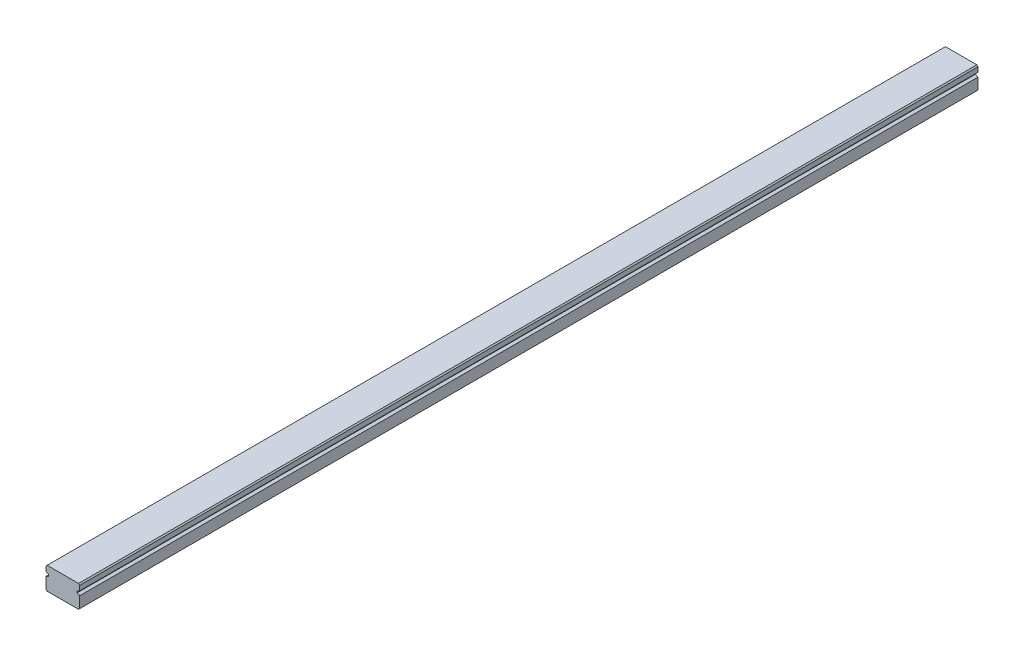
ISO-10303-21;
HEADER;
FILE_DESCRIPTION(('STEP AP214'),'2;1');
FILE_NAME('part.step','',(''),(''),'','','');
FILE_SCHEMA(('AUTOMOTIVE_DESIGN { 1 0 10303 214 1 1 1 1 }'));
ENDSEC;
DATA;
#1=APPLICATION_CONTEXT('core data for automotive mechanical design processes');
#2=APPLICATION_PROTOCOL_DEFINITION('international standard','automotive_design',2000,#1);
#3=PRODUCT_CONTEXT('',#1,'mechanical');
#4=PRODUCT('Part','Part','',(#3));
#5=PRODUCT_RELATED_PRODUCT_CATEGORY('part','',(#4));
#6=PRODUCT_DEFINITION_FORMATION('','',#4);
#7=PRODUCT_DEFINITION_CONTEXT('part definition',#1,'design');
#8=PRODUCT_DEFINITION('design','',#6,#7);
#9=PRODUCT_DEFINITION_SHAPE('','',#8);
#10=(LENGTH_UNIT() NAMED_UNIT(*) SI_UNIT(.MILLI.,.METRE.));
#11=(NAMED_UNIT(*) PLANE_ANGLE_UNIT() SI_UNIT($,.RADIAN.));
#12=(NAMED_UNIT(*) SI_UNIT($,.STERADIAN.) SOLID_ANGLE_UNIT());
#13=UNCERTAINTY_MEASURE_WITH_UNIT(LENGTH_MEASURE(1.E-05),#10,'distance_accuracy_value','');
#14=(GEOMETRIC_REPRESENTATION_CONTEXT(3) GLOBAL_UNCERTAINTY_ASSIGNED_CONTEXT((#13)) GLOBAL_UNIT_ASSIGNED_CONTEXT((#10,
#11,#12)) REPRESENTATION_CONTEXT('',''));
#15=CARTESIAN_POINT('',(0.,0.,0.));
#16=DIRECTION('',(0.,0.,1.));
#17=DIRECTION('',(1.,0.,0.));
#18=AXIS2_PLACEMENT_3D('',#15,#16,#17);
#19=CARTESIAN_POINT('',(11.2309644670051,0.449238578680204,-400.));
#20=DIRECTION('',(1.,0.,0.));
#21=DIRECTION('',(0.,1.,0.));
#22=AXIS2_PLACEMENT_3D('',#19,#20,#21);
#23=PLANE('',#22);
#24=DIRECTION('',(0.,1.,0.));
#25=VECTOR('',#24,1.);
#26=CARTESIAN_POINT('',(11.2309644670051,0.449238578680204,0.));
#27=LINE('',#26,#25);
#28=CARTESIAN_POINT('',(11.2309644670051,-4.5507614213198,0.));
#29=VERTEX_POINT('',#28);
#30=CARTESIAN_POINT('',(11.2309644670051,0.449238578680204,0.));
#31=VERTEX_POINT('',#30);
#32=EDGE_CURVE('E190',#29,#31,#27,.T.);
#33=ORIENTED_EDGE('',*,*,#32,.F.);
#34=DIRECTION('',(0.,0.,1.));
#35=VECTOR('',#34,1.);
#36=CARTESIAN_POINT('',(11.2309644670051,-4.5507614213198,-400.));
#37=LINE('',#36,#35);
#38=CARTESIAN_POINT('',(11.2309644670051,-4.5507614213198,-400.));
#39=VERTEX_POINT('',#38);
#40=EDGE_CURVE('E11',#39,#29,#37,.T.);
#41=ORIENTED_EDGE('',*,*,#40,.F.);
#42=DIRECTION('',(0.,1.,0.));
#43=VECTOR('',#42,1.);
#44=CARTESIAN_POINT('',(11.2309644670051,0.449238578680204,-400.));
#45=LINE('',#44,#43);
#46=CARTESIAN_POINT('',(11.2309644670051,0.449238578680204,-400.));
#47=VERTEX_POINT('',#46);
#48=EDGE_CURVE('E250',#39,#47,#45,.T.);
#49=ORIENTED_EDGE('',*,*,#48,.T.);
#50=DIRECTION('',(0.,0.,1.));
#51=VECTOR('',#50,1.);
#52=CARTESIAN_POINT('',(11.2309644670051,0.449238578680204,-400.));
#53=LINE('',#52,#51);
#54=EDGE_CURVE('E42',#47,#31,#53,.T.);
#55=ORIENTED_EDGE('',*,*,#54,.T.);
#56=EDGE_LOOP('',(#33,#41,#49,#55));
#57=FACE_BOUND('',#56,.T.);
#58=ADVANCED_FACE('F39',(#57),#23,.T.);
#59=CARTESIAN_POINT('',(11.2309644670051,-4.5507614213198,-400.));
#60=DIRECTION('',(0.707106781186547,-0.707106781186548,0.));
#61=DIRECTION('',(0.707106781186548,0.707106781186547,0.));
#62=AXIS2_PLACEMENT_3D('',#59,#60,#61);
#63=PLANE('',#62);
#64=DIRECTION('',(0.707106781186548,0.707106781186547,0.));
#65=VECTOR('',#64,1.);
#66=CARTESIAN_POINT('',(11.2309644670051,-4.5507614213198,0.));
#67=LINE('',#66,#65);
#68=CARTESIAN_POINT('',(10.7309644670051,-5.0507614213198,0.));
#69=VERTEX_POINT('',#68);
#70=EDGE_CURVE('E247',#69,#29,#67,.T.);
#71=ORIENTED_EDGE('',*,*,#70,.F.);
#72=DIRECTION('',(0.,0.,1.));
#73=VECTOR('',#72,1.);
#74=CARTESIAN_POINT('',(10.7309644670051,-5.0507614213198,-400.));
#75=LINE('',#74,#73);
#76=CARTESIAN_POINT('',(10.7309644670051,-5.0507614213198,-400.));
#77=VERTEX_POINT('',#76);
#78=EDGE_CURVE('E49',#77,#69,#75,.T.);
#79=ORIENTED_EDGE('',*,*,#78,.F.);
#80=DIRECTION('',(0.707106781186548,0.707106781186547,0.));
#81=VECTOR('',#80,1.);
#82=CARTESIAN_POINT('',(11.2309644670051,-4.5507614213198,-400.));
#83=LINE('',#82,#81);
#84=EDGE_CURVE('E176',#77,#39,#83,.T.);
#85=ORIENTED_EDGE('',*,*,#84,.T.);
#86=ORIENTED_EDGE('',*,*,#40,.T.);
#87=EDGE_LOOP('',(#71,#79,#85,#86));
#88=FACE_BOUND('',#87,.T.);
#89=ADVANCED_FACE('F292',(#88),#63,.T.);
#90=CARTESIAN_POINT('',(-3.26903553299492,-5.0507614213198,-400.));
#91=DIRECTION('',(0.,-1.,0.));
#92=DIRECTION('',(0.,0.,-1.));
#93=AXIS2_PLACEMENT_3D('',#90,#91,#92);
#94=PLANE('',#93);
#95=DIRECTION('',(1.,0.,0.));
#96=VECTOR('',#95,1.);
#97=CARTESIAN_POINT('',(-3.26903553299492,-5.0507614213198,0.));
#98=LINE('',#97,#96);
#99=CARTESIAN_POINT('',(-3.26903553299492,-5.0507614213198,0.));
#100=VERTEX_POINT('',#99);
#101=EDGE_CURVE('E162',#100,#69,#98,.T.);
#102=ORIENTED_EDGE('',*,*,#101,.F.);
#103=DIRECTION('',(0.,0.,1.));
#104=VECTOR('',#103,1.);
#105=CARTESIAN_POINT('',(-3.26903553299492,-5.0507614213198,-400.));
#106=LINE('',#105,#104);
#107=CARTESIAN_POINT('',(-3.26903553299492,-5.0507614213198,-400.));
#108=VERTEX_POINT('',#107);
#109=EDGE_CURVE('E157',#108,#100,#106,.T.);
#110=ORIENTED_EDGE('',*,*,#109,.F.);
#111=DIRECTION('',(1.,0.,0.));
#112=VECTOR('',#111,1.);
#113=CARTESIAN_POINT('',(-3.26903553299492,-5.0507614213198,-400.));
#114=LINE('',#113,#112);
#115=EDGE_CURVE('E160',#108,#77,#114,.T.);
#116=ORIENTED_EDGE('',*,*,#115,.T.);
#117=ORIENTED_EDGE('',*,*,#78,.T.);
#118=EDGE_LOOP('',(#102,#110,#116,#117));
#119=FACE_BOUND('',#118,.T.);
#120=ADVANCED_FACE('F159',(#119),#94,.T.);
#121=CARTESIAN_POINT('',(-3.76903553299492,-4.5507614213198,-400.));
#122=DIRECTION('',(-0.707106781186547,-0.707106781186548,0.));
#123=DIRECTION('',(0.707106781186548,-0.707106781186547,0.));
#124=AXIS2_PLACEMENT_3D('',#121,#122,#123);
#125=PLANE('',#124);
#126=DIRECTION('',(0.707106781186548,-0.707106781186547,0.));
#127=VECTOR('',#126,1.);
#128=CARTESIAN_POINT('',(-3.76903553299492,-4.5507614213198,0.));
#129=LINE('',#128,#127);
#130=CARTESIAN_POINT('',(-3.76903553299492,-4.5507614213198,0.));
#131=VERTEX_POINT('',#130);
#132=EDGE_CURVE('E242',#131,#100,#129,.T.);
#133=ORIENTED_EDGE('',*,*,#132,.F.);
#134=DIRECTION('',(0.,0.,1.));
#135=VECTOR('',#134,1.);
#136=CARTESIAN_POINT('',(-3.76903553299492,-4.5507614213198,-400.));
#137=LINE('',#136,#135);
#138=CARTESIAN_POINT('',(-3.76903553299492,-4.5507614213198,-400.));
#139=VERTEX_POINT('',#138);
#140=EDGE_CURVE('E168',#139,#131,#137,.T.);
#141=ORIENTED_EDGE('',*,*,#140,.F.);
#142=DIRECTION('',(0.707106781186548,-0.707106781186547,0.));
#143=VECTOR('',#142,1.);
#144=CARTESIAN_POINT('',(-3.76903553299492,-4.5507614213198,-400.));
#145=LINE('',#144,#143);
#146=EDGE_CURVE('E174',#139,#108,#145,.T.);
#147=ORIENTED_EDGE('',*,*,#146,.T.);
#148=ORIENTED_EDGE('',*,*,#109,.T.);
#149=EDGE_LOOP('',(#133,#141,#147,#148));
#150=FACE_BOUND('',#149,.T.);
#151=ADVANCED_FACE('F179',(#150),#125,.T.);
#152=CARTESIAN_POINT('',(-3.76903553299492,0.449238578680202,-400.));
#153=DIRECTION('',(-1.,0.,0.));
#154=DIRECTION('',(0.,-1.,0.));
#155=AXIS2_PLACEMENT_3D('',#152,#153,#154);
#156=PLANE('',#155);
#157=DIRECTION('',(0.,-1.,0.));
#158=VECTOR('',#157,1.);
#159=CARTESIAN_POINT('',(-3.76903553299492,0.449238578680202,0.));
#160=LINE('',#159,#158);
#161=CARTESIAN_POINT('',(-3.76903553299492,0.449238578680202,0.));
#162=VERTEX_POINT('',#161);
#163=EDGE_CURVE('E238',#162,#131,#160,.T.);
#164=ORIENTED_EDGE('',*,*,#163,.F.);
#165=DIRECTION('',(0.,0.,1.));
#166=VECTOR('',#165,1.);
#167=CARTESIAN_POINT('',(-3.76903553299492,0.449238578680202,-400.));
#168=LINE('',#167,#166);
#169=CARTESIAN_POINT('',(-3.76903553299492,0.449238578680202,-400.));
#170=VERTEX_POINT('',#169);
#171=EDGE_CURVE('E256',#170,#162,#168,.T.);
#172=ORIENTED_EDGE('',*,*,#171,.F.);
#173=DIRECTION('',(0.,-1.,0.));
#174=VECTOR('',#173,1.);
#175=CARTESIAN_POINT('',(-3.76903553299492,0.449238578680202,-400.));
#176=LINE('',#175,#174);
#177=EDGE_CURVE('E181',#170,#139,#176,.T.);
#178=ORIENTED_EDGE('',*,*,#177,.T.);
#179=ORIENTED_EDGE('',*,*,#140,.T.);
#180=EDGE_LOOP('',(#164,#172,#178,#179));
#181=FACE_BOUND('',#180,.T.);
#182=ADVANCED_FACE('F305',(#181),#156,.T.);
#183=CARTESIAN_POINT('',(-3.76903553299492,0.449238578680202,-400.));
#184=DIRECTION('',(-0.423002146128656,0.906128679807979,0.));
#185=DIRECTION('',(-0.906128679807979,-0.423002146128656,0.));
#186=AXIS2_PLACEMENT_3D('',#183,#184,#185);
#187=PLANE('',#186);
#188=DIRECTION('',(-0.906128679807979,-0.423002146128656,0.));
#189=VECTOR('',#188,1.);
#190=CARTESIAN_POINT('',(-3.76903553299492,0.449238578680202,0.));
#191=LINE('',#190,#189);
#192=CARTESIAN_POINT('',(-2.62483572335025,0.983377918781723,0.));
#193=VERTEX_POINT('',#192);
#194=EDGE_CURVE('E234',#193,#162,#191,.T.);
#195=ORIENTED_EDGE('',*,*,#194,.F.);
#196=DIRECTION('',(0.,0.,1.));
#197=VECTOR('',#196,1.);
#198=CARTESIAN_POINT('',(-2.62483572335025,0.983377918781723,-400.));
#199=LINE('',#198,#197);
#200=CARTESIAN_POINT('',(-2.62483572335025,0.983377918781723,-400.));
#201=VERTEX_POINT('',#200);
#202=EDGE_CURVE('E259',#201,#193,#199,.T.);
#203=ORIENTED_EDGE('',*,*,#202,.F.);
#204=DIRECTION('',(-0.906128679807979,-0.423002146128656,0.));
#205=VECTOR('',#204,1.);
#206=CARTESIAN_POINT('',(-3.76903553299492,0.449238578680202,-400.));
#207=LINE('',#206,#205);
#208=EDGE_CURVE('E184',#201,#170,#207,.T.);
#209=ORIENTED_EDGE('',*,*,#208,.T.);
#210=ORIENTED_EDGE('',*,*,#171,.T.);
#211=EDGE_LOOP('',(#195,#203,#209,#210));
#212=FACE_BOUND('',#211,.T.);
#213=ADVANCED_FACE('F308',(#212),#187,.T.);
#214=CARTESIAN_POINT('',(-2.62483572335025,0.983377918781723,-400.));
#215=DIRECTION('',(-1.,0.,0.));
#216=DIRECTION('',(0.,0.,1.));
#217=AXIS2_PLACEMENT_3D('',#214,#215,#216);
#218=PLANE('',#217);
#219=DIRECTION('',(0.,-1.,0.));
#220=VECTOR('',#219,1.);
#221=CARTESIAN_POINT('',(-2.62483572335025,0.983377918781723,0.));
#222=LINE('',#221,#220);
#223=CARTESIAN_POINT('',(-2.62483572335025,1.78337791878172,0.));
#224=VERTEX_POINT('',#223);
#225=EDGE_CURVE('E230',#224,#193,#222,.T.);
#226=ORIENTED_EDGE('',*,*,#225,.F.);
#227=DIRECTION('',(0.,0.,1.));
#228=VECTOR('',#227,1.);
#229=CARTESIAN_POINT('',(-2.62483572335025,1.78337791878172,-400.));
#230=LINE('',#229,#228);
#231=CARTESIAN_POINT('',(-2.62483572335025,1.78337791878172,-400.));
#232=VERTEX_POINT('',#231);
#233=EDGE_CURVE('E262',#232,#224,#230,.T.);
#234=ORIENTED_EDGE('',*,*,#233,.F.);
#235=DIRECTION('',(0.,-1.,0.));
#236=VECTOR('',#235,1.);
#237=CARTESIAN_POINT('',(-2.62483572335025,0.983377918781723,-400.));
#238=LINE('',#237,#236);
#239=EDGE_CURVE('E489',#232,#201,#238,.T.);
#240=ORIENTED_EDGE('',*,*,#239,.T.);
#241=ORIENTED_EDGE('',*,*,#202,.T.);
#242=EDGE_LOOP('',(#226,#234,#240,#241));
#243=FACE_BOUND('',#242,.T.);
#244=ADVANCED_FACE('F312',(#243),#218,.T.);
#245=CARTESIAN_POINT('',(-3.76903553299492,2.31751725888324,-400.));
#246=DIRECTION('',(-0.423002146128656,-0.906128679807979,0.));
#247=DIRECTION('',(0.906128679807979,-0.423002146128656,0.));
#248=AXIS2_PLACEMENT_3D('',#245,#246,#247);
#249=PLANE('',#248);
#250=DIRECTION('',(0.906128679807979,-0.423002146128656,0.));
#251=VECTOR('',#250,1.);
#252=CARTESIAN_POINT('',(-3.76903553299492,2.31751725888324,0.));
#253=LINE('',#252,#251);
#254=CARTESIAN_POINT('',(-3.76903553299492,2.31751725888324,0.));
#255=VERTEX_POINT('',#254);
#256=EDGE_CURVE('E226',#255,#224,#253,.T.);
#257=ORIENTED_EDGE('',*,*,#256,.F.);
#258=DIRECTION('',(0.,0.,1.));
#259=VECTOR('',#258,1.);
#260=CARTESIAN_POINT('',(-3.76903553299492,2.31751725888324,-400.));
#261=LINE('',#260,#259);
#262=CARTESIAN_POINT('',(-3.76903553299492,2.31751725888324,-400.));
#263=VERTEX_POINT('',#262);
#264=EDGE_CURVE('E265',#263,#255,#261,.T.);
#265=ORIENTED_EDGE('',*,*,#264,.F.);
#266=DIRECTION('',(0.906128679807979,-0.423002146128656,0.));
#267=VECTOR('',#266,1.);
#268=CARTESIAN_POINT('',(-3.76903553299492,2.31751725888324,-400.));
#269=LINE('',#268,#267);
#270=EDGE_CURVE('E485',#263,#232,#269,.T.);
#271=ORIENTED_EDGE('',*,*,#270,.T.);
#272=ORIENTED_EDGE('',*,*,#233,.T.);
#273=EDGE_LOOP('',(#257,#265,#271,#272));
#274=FACE_BOUND('',#273,.T.);
#275=ADVANCED_FACE('F316',(#274),#249,.T.);
#276=CARTESIAN_POINT('',(-3.76903553299492,4.4492385786802,-400.));
#277=DIRECTION('',(-1.,0.,0.));
#278=DIRECTION('',(0.,-1.,0.));
#279=AXIS2_PLACEMENT_3D('',#276,#277,#278);
#280=PLANE('',#279);
#281=DIRECTION('',(0.,-1.,0.));
#282=VECTOR('',#281,1.);
#283=CARTESIAN_POINT('',(-3.76903553299492,4.4492385786802,0.));
#284=LINE('',#283,#282);
#285=CARTESIAN_POINT('',(-3.76903553299492,4.4492385786802,0.));
#286=VERTEX_POINT('',#285);
#287=EDGE_CURVE('E222',#286,#255,#284,.T.);
#288=ORIENTED_EDGE('',*,*,#287,.F.);
#289=DIRECTION('',(0.,0.,1.));
#290=VECTOR('',#289,1.);
#291=CARTESIAN_POINT('',(-3.76903553299492,4.4492385786802,-400.));
#292=LINE('',#291,#290);
#293=CARTESIAN_POINT('',(-3.76903553299492,4.4492385786802,-400.));
#294=VERTEX_POINT('',#293);
#295=EDGE_CURVE('E268',#294,#286,#292,.T.);
#296=ORIENTED_EDGE('',*,*,#295,.F.);
#297=DIRECTION('',(0.,-1.,0.));
#298=VECTOR('',#297,1.);
#299=CARTESIAN_POINT('',(-3.76903553299492,4.4492385786802,-400.));
#300=LINE('',#299,#298);
#301=EDGE_CURVE('E499',#294,#263,#300,.T.);
#302=ORIENTED_EDGE('',*,*,#301,.T.);
#303=ORIENTED_EDGE('',*,*,#264,.T.);
#304=EDGE_LOOP('',(#288,#296,#302,#303));
#305=FACE_BOUND('',#304,.T.);
#306=ADVANCED_FACE('F320',(#305),#280,.T.);
#307=CARTESIAN_POINT('',(-3.76903553299492,4.4492385786802,-400.));
#308=DIRECTION('',(-0.707106781186548,0.707106781186548,0.));
#309=DIRECTION('',(-0.707106781186548,-0.707106781186548,0.));
#310=AXIS2_PLACEMENT_3D('',#307,#308,#309);
#311=PLANE('',#310);
#312=DIRECTION('',(-0.707106781186548,-0.707106781186548,0.));
#313=VECTOR('',#312,1.);
#314=CARTESIAN_POINT('',(-3.76903553299492,4.4492385786802,0.));
#315=LINE('',#314,#313);
#316=CARTESIAN_POINT('',(-3.26903553299492,4.9492385786802,0.));
#317=VERTEX_POINT('',#316);
#318=EDGE_CURVE('E218',#317,#286,#315,.T.);
#319=ORIENTED_EDGE('',*,*,#318,.F.);
#320=DIRECTION('',(0.,0.,1.));
#321=VECTOR('',#320,1.);
#322=CARTESIAN_POINT('',(-3.26903553299492,4.9492385786802,-400.));
#323=LINE('',#322,#321);
#324=CARTESIAN_POINT('',(-3.26903553299492,4.9492385786802,-400.));
#325=VERTEX_POINT('',#324);
#326=EDGE_CURVE('E271',#325,#317,#323,.T.);
#327=ORIENTED_EDGE('',*,*,#326,.F.);
#328=DIRECTION('',(-0.707106781186548,-0.707106781186548,0.));
#329=VECTOR('',#328,1.);
#330=CARTESIAN_POINT('',(-3.76903553299492,4.4492385786802,-400.));
#331=LINE('',#330,#329);
#332=EDGE_CURVE('E478',#325,#294,#331,.T.);
#333=ORIENTED_EDGE('',*,*,#332,.T.);
#334=ORIENTED_EDGE('',*,*,#295,.T.);
#335=EDGE_LOOP('',(#319,#327,#333,#334));
#336=FACE_BOUND('',#335,.T.);
#337=ADVANCED_FACE('F324',(#336),#311,.T.);
#338=CARTESIAN_POINT('',(-3.26903553299492,4.9492385786802,-400.));
#339=DIRECTION('',(0.,1.,0.));
#340=DIRECTION('',(0.,0.,1.));
#341=AXIS2_PLACEMENT_3D('',#338,#339,#340);
#342=PLANE('',#341);
#343=DIRECTION('',(-1.,0.,0.));
#344=VECTOR('',#343,1.);
#345=CARTESIAN_POINT('',(-3.26903553299492,4.9492385786802,0.));
#346=LINE('',#345,#344);
#347=CARTESIAN_POINT('',(10.7309644670051,4.9492385786802,0.));
#348=VERTEX_POINT('',#347);
#349=EDGE_CURVE('E214',#348,#317,#346,.T.);
#350=ORIENTED_EDGE('',*,*,#349,.F.);
#351=DIRECTION('',(0.,0.,1.));
#352=VECTOR('',#351,1.);
#353=CARTESIAN_POINT('',(10.7309644670051,4.9492385786802,-400.));
#354=LINE('',#353,#352);
#355=CARTESIAN_POINT('',(10.7309644670051,4.9492385786802,-400.));
#356=VERTEX_POINT('',#355);
#357=EDGE_CURVE('E274',#356,#348,#354,.T.);
#358=ORIENTED_EDGE('',*,*,#357,.F.);
#359=DIRECTION('',(-1.,0.,0.));
#360=VECTOR('',#359,1.);
#361=CARTESIAN_POINT('',(-3.26903553299492,4.9492385786802,-400.));
#362=LINE('',#361,#360);
#363=EDGE_CURVE('E474',#356,#325,#362,.T.);
#364=ORIENTED_EDGE('',*,*,#363,.T.);
#365=ORIENTED_EDGE('',*,*,#326,.T.);
#366=EDGE_LOOP('',(#350,#358,#364,#365));
#367=FACE_BOUND('',#366,.T.);
#368=ADVANCED_FACE('F328',(#367),#342,.T.);
#369=CARTESIAN_POINT('',(10.7309644670051,4.9492385786802,-400.));
#370=DIRECTION('',(0.707106781186547,0.707106781186548,0.));
#371=DIRECTION('',(-0.707106781186548,0.707106781186547,0.));
#372=AXIS2_PLACEMENT_3D('',#369,#370,#371);
#373=PLANE('',#372);
#374=DIRECTION('',(-0.707106781186548,0.707106781186547,0.));
#375=VECTOR('',#374,1.);
#376=CARTESIAN_POINT('',(10.7309644670051,4.9492385786802,0.));
#377=LINE('',#376,#375);
#378=CARTESIAN_POINT('',(11.2309644670051,4.4492385786802,0.));
#379=VERTEX_POINT('',#378);
#380=EDGE_CURVE('E210',#379,#348,#377,.T.);
#381=ORIENTED_EDGE('',*,*,#380,.F.);
#382=DIRECTION('',(0.,0.,1.));
#383=VECTOR('',#382,1.);
#384=CARTESIAN_POINT('',(11.2309644670051,4.4492385786802,-400.));
#385=LINE('',#384,#383);
#386=CARTESIAN_POINT('',(11.2309644670051,4.4492385786802,-400.));
#387=VERTEX_POINT('',#386);
#388=EDGE_CURVE('E277',#387,#379,#385,.T.);
#389=ORIENTED_EDGE('',*,*,#388,.F.);
#390=DIRECTION('',(-0.707106781186548,0.707106781186547,0.));
#391=VECTOR('',#390,1.);
#392=CARTESIAN_POINT('',(10.7309644670051,4.9492385786802,-400.));
#393=LINE('',#392,#391);
#394=EDGE_CURVE('E506',#387,#356,#393,.T.);
#395=ORIENTED_EDGE('',*,*,#394,.T.);
#396=ORIENTED_EDGE('',*,*,#357,.T.);
#397=EDGE_LOOP('',(#381,#389,#395,#396));
#398=FACE_BOUND('',#397,.T.);
#399=ADVANCED_FACE('F332',(#398),#373,.T.);
#400=CARTESIAN_POINT('',(11.2309644670051,4.4492385786802,-400.));
#401=DIRECTION('',(1.,0.,0.));
#402=DIRECTION('',(0.,0.,-1.));
#403=AXIS2_PLACEMENT_3D('',#400,#401,#402);
#404=PLANE('',#403);
#405=DIRECTION('',(0.,1.,0.));
#406=VECTOR('',#405,1.);
#407=CARTESIAN_POINT('',(11.2309644670051,4.4492385786802,0.));
#408=LINE('',#407,#406);
#409=CARTESIAN_POINT('',(11.2309644670051,2.31751725888325,0.));
#410=VERTEX_POINT('',#409);
#411=EDGE_CURVE('E206',#410,#379,#408,.T.);
#412=ORIENTED_EDGE('',*,*,#411,.F.);
#413=DIRECTION('',(0.,0.,1.));
#414=VECTOR('',#413,1.);
#415=CARTESIAN_POINT('',(11.2309644670051,2.31751725888325,-400.));
#416=LINE('',#415,#414);
#417=CARTESIAN_POINT('',(11.2309644670051,2.31751725888325,-400.));
#418=VERTEX_POINT('',#417);
#419=EDGE_CURVE('E280',#418,#410,#416,.T.);
#420=ORIENTED_EDGE('',*,*,#419,.F.);
#421=DIRECTION('',(0.,1.,0.));
#422=VECTOR('',#421,1.);
#423=CARTESIAN_POINT('',(11.2309644670051,4.4492385786802,-400.));
#424=LINE('',#423,#422);
#425=EDGE_CURVE('E467',#418,#387,#424,.T.);
#426=ORIENTED_EDGE('',*,*,#425,.T.);
#427=ORIENTED_EDGE('',*,*,#388,.T.);
#428=EDGE_LOOP('',(#412,#420,#426,#427));
#429=FACE_BOUND('',#428,.T.);
#430=ADVANCED_FACE('F336',(#429),#404,.T.);
#431=CARTESIAN_POINT('',(11.2309644670051,2.31751725888325,-400.));
#432=DIRECTION('',(0.423002146128656,-0.906128679807979,0.));
#433=DIRECTION('',(0.906128679807979,0.423002146128656,0.));
#434=AXIS2_PLACEMENT_3D('',#431,#432,#433);
#435=PLANE('',#434);
#436=DIRECTION('',(0.906128679807979,0.423002146128656,0.));
#437=VECTOR('',#436,1.);
#438=CARTESIAN_POINT('',(11.2309644670051,2.31751725888325,0.));
#439=LINE('',#438,#437);
#440=CARTESIAN_POINT('',(10.0867646573604,1.78337791878172,0.));
#441=VERTEX_POINT('',#440);
#442=EDGE_CURVE('E202',#441,#410,#439,.T.);
#443=ORIENTED_EDGE('',*,*,#442,.F.);
#444=DIRECTION('',(0.,0.,1.));
#445=VECTOR('',#444,1.);
#446=CARTESIAN_POINT('',(10.0867646573604,1.78337791878172,-400.));
#447=LINE('',#446,#445);
#448=CARTESIAN_POINT('',(10.0867646573604,1.78337791878172,-400.));
#449=VERTEX_POINT('',#448);
#450=EDGE_CURVE('E283',#449,#441,#447,.T.);
#451=ORIENTED_EDGE('',*,*,#450,.F.);
#452=DIRECTION('',(0.906128679807979,0.423002146128656,0.));
#453=VECTOR('',#452,1.);
#454=CARTESIAN_POINT('',(11.2309644670051,2.31751725888325,-400.));
#455=LINE('',#454,#453);
#456=EDGE_CURVE('E463',#449,#418,#455,.T.);
#457=ORIENTED_EDGE('',*,*,#456,.T.);
#458=ORIENTED_EDGE('',*,*,#419,.T.);
#459=EDGE_LOOP('',(#443,#451,#457,#458));
#460=FACE_BOUND('',#459,.T.);
#461=ADVANCED_FACE('F340',(#460),#435,.T.);
#462=CARTESIAN_POINT('',(10.0867646573604,0.983377918781725,-400.));
#463=DIRECTION('',(1.,0.,0.));
#464=DIRECTION('',(0.,0.,-1.));
#465=AXIS2_PLACEMENT_3D('',#462,#463,#464);
#466=PLANE('',#465);
#467=DIRECTION('',(0.,1.,0.));
#468=VECTOR('',#467,1.);
#469=CARTESIAN_POINT('',(10.0867646573604,0.983377918781725,0.));
#470=LINE('',#469,#468);
#471=CARTESIAN_POINT('',(10.0867646573604,0.983377918781725,0.));
#472=VERTEX_POINT('',#471);
#473=EDGE_CURVE('E198',#472,#441,#470,.T.);
#474=ORIENTED_EDGE('',*,*,#473,.F.);
#475=DIRECTION('',(0.,0.,1.));
#476=VECTOR('',#475,1.);
#477=CARTESIAN_POINT('',(10.0867646573604,0.983377918781725,-400.));
#478=LINE('',#477,#476);
#479=CARTESIAN_POINT('',(10.0867646573604,0.983377918781725,-400.));
#480=VERTEX_POINT('',#479);
#481=EDGE_CURVE('E285',#480,#472,#478,.T.);
#482=ORIENTED_EDGE('',*,*,#481,.F.);
#483=DIRECTION('',(0.,1.,0.));
#484=VECTOR('',#483,1.);
#485=CARTESIAN_POINT('',(10.0867646573604,0.983377918781725,-400.));
#486=LINE('',#485,#484);
#487=EDGE_CURVE('E513',#480,#449,#486,.T.);
#488=ORIENTED_EDGE('',*,*,#487,.T.);
#489=ORIENTED_EDGE('',*,*,#450,.T.);
#490=EDGE_LOOP('',(#474,#482,#488,#489));
#491=FACE_BOUND('',#490,.T.);
#492=ADVANCED_FACE('F344',(#491),#466,.T.);
#493=CARTESIAN_POINT('',(11.2309644670051,0.449238578680204,-400.));
#494=DIRECTION('',(0.423002146128656,0.906128679807979,0.));
#495=DIRECTION('',(-0.906128679807979,0.423002146128656,0.));
#496=AXIS2_PLACEMENT_3D('',#493,#494,#495);
#497=PLANE('',#496);
#498=DIRECTION('',(-0.906128679807979,0.423002146128656,0.));
#499=VECTOR('',#498,1.);
#500=CARTESIAN_POINT('',(11.2309644670051,0.449238578680204,0.));
#501=LINE('',#500,#499);
#502=EDGE_CURVE('E194',#31,#472,#501,.T.);
#503=ORIENTED_EDGE('',*,*,#502,.F.);
#504=ORIENTED_EDGE('',*,*,#54,.F.);
#505=DIRECTION('',(-0.906128679807979,0.423002146128656,0.));
#506=VECTOR('',#505,1.);
#507=CARTESIAN_POINT('',(11.2309644670051,0.449238578680204,-400.));
#508=LINE('',#507,#506);
#509=EDGE_CURVE('E516',#47,#480,#508,.T.);
#510=ORIENTED_EDGE('',*,*,#509,.T.);
#511=ORIENTED_EDGE('',*,*,#481,.T.);
#512=EDGE_LOOP('',(#503,#504,#510,#511));
#513=FACE_BOUND('',#512,.T.);
#514=ADVANCED_FACE('F289',(#513),#497,.T.);
#515=CARTESIAN_POINT('',(0.,0.,-400.));
#516=DIRECTION('',(0.,0.,1.));
#517=DIRECTION('',(1.,0.,0.));
#518=AXIS2_PLACEMENT_3D('',#515,#516,#517);
#519=PLANE('',#518);
#520=ORIENTED_EDGE('',*,*,#48,.F.);
#521=ORIENTED_EDGE('',*,*,#84,.F.);
#522=ORIENTED_EDGE('',*,*,#115,.F.);
#523=ORIENTED_EDGE('',*,*,#146,.F.);
#524=ORIENTED_EDGE('',*,*,#177,.F.);
#525=ORIENTED_EDGE('',*,*,#208,.F.);
#526=ORIENTED_EDGE('',*,*,#239,.F.);
#527=ORIENTED_EDGE('',*,*,#270,.F.);
#528=ORIENTED_EDGE('',*,*,#301,.F.);
#529=ORIENTED_EDGE('',*,*,#332,.F.);
#530=ORIENTED_EDGE('',*,*,#363,.F.);
#531=ORIENTED_EDGE('',*,*,#394,.F.);
#532=ORIENTED_EDGE('',*,*,#425,.F.);
#533=ORIENTED_EDGE('',*,*,#456,.F.);
#534=ORIENTED_EDGE('',*,*,#487,.F.);
#535=ORIENTED_EDGE('',*,*,#509,.F.);
#536=EDGE_LOOP('',(#520,#521,#522,#523,#524,#525,#526,#527,#528,#529,#530,#531,#532,#533,#534,#535));
#537=FACE_BOUND('',#536,.T.);
#538=ADVANCED_FACE('F172',(#537),#519,.F.);
#539=CARTESIAN_POINT('',(0.,0.,0.));
#540=DIRECTION('',(0.,0.,1.));
#541=DIRECTION('',(1.,0.,0.));
#542=AXIS2_PLACEMENT_3D('',#539,#540,#541);
#543=PLANE('',#542);
#544=ORIENTED_EDGE('',*,*,#32,.T.);
#545=ORIENTED_EDGE('',*,*,#502,.T.);
#546=ORIENTED_EDGE('',*,*,#473,.T.);
#547=ORIENTED_EDGE('',*,*,#442,.T.);
#548=ORIENTED_EDGE('',*,*,#411,.T.);
#549=ORIENTED_EDGE('',*,*,#380,.T.);
#550=ORIENTED_EDGE('',*,*,#349,.T.);
#551=ORIENTED_EDGE('',*,*,#318,.T.);
#552=ORIENTED_EDGE('',*,*,#287,.T.);
#553=ORIENTED_EDGE('',*,*,#256,.T.);
#554=ORIENTED_EDGE('',*,*,#225,.T.);
#555=ORIENTED_EDGE('',*,*,#194,.T.);
#556=ORIENTED_EDGE('',*,*,#163,.T.);
#557=ORIENTED_EDGE('',*,*,#132,.T.);
#558=ORIENTED_EDGE('',*,*,#101,.T.);
#559=ORIENTED_EDGE('',*,*,#70,.T.);
#560=EDGE_LOOP('',(#544,#545,#546,#547,#548,#549,#550,#551,#552,#553,#554,#555,#556,#557,#558,#559));
#561=FACE_BOUND('',#560,.T.);
#562=ADVANCED_FACE('F291',(#561),#543,.T.);
#563=CLOSED_SHELL('',(#58,#89,#120,#151,#182,#213,#244,#275,#306,#337,#368,#399,#430,#461,#492,
#514,#538,#562));
#564=MANIFOLD_SOLID_BREP('B2',#563);
#565=ADVANCED_BREP_SHAPE_REPRESENTATION('',(#18,#564),#14);
#566=SHAPE_DEFINITION_REPRESENTATION(#9,#565);
ENDSEC;
END-ISO-10303-21;
